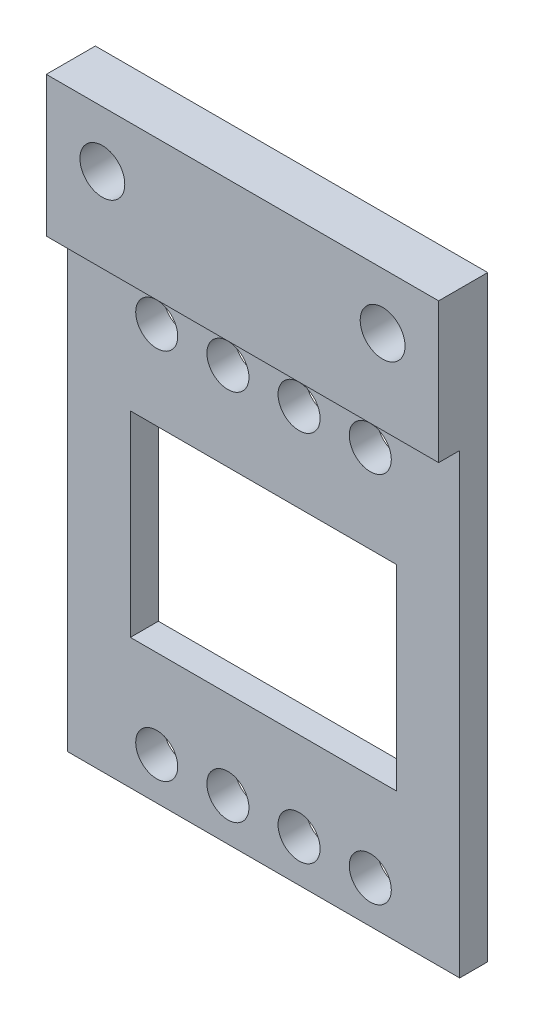
ISO-10303-21;
HEADER;
FILE_DESCRIPTION(('STEP AP214'),'2;1');
FILE_NAME('part.step','',(''),(''),'','','');
FILE_SCHEMA(('AUTOMOTIVE_DESIGN { 1 0 10303 214 1 1 1 1 }'));
ENDSEC;
DATA;
#1=APPLICATION_CONTEXT('core data for automotive mechanical design processes');
#2=APPLICATION_PROTOCOL_DEFINITION('international standard','automotive_design',2000,#1);
#3=PRODUCT_CONTEXT('',#1,'mechanical');
#4=PRODUCT('Part','Part','',(#3));
#5=PRODUCT_RELATED_PRODUCT_CATEGORY('part','',(#4));
#6=PRODUCT_DEFINITION_FORMATION('','',#4);
#7=PRODUCT_DEFINITION_CONTEXT('part definition',#1,'design');
#8=PRODUCT_DEFINITION('design','',#6,#7);
#9=PRODUCT_DEFINITION_SHAPE('','',#8);
#10=(LENGTH_UNIT() NAMED_UNIT(*) SI_UNIT(.MILLI.,.METRE.));
#11=(NAMED_UNIT(*) PLANE_ANGLE_UNIT() SI_UNIT($,.RADIAN.));
#12=(NAMED_UNIT(*) SI_UNIT($,.STERADIAN.) SOLID_ANGLE_UNIT());
#13=UNCERTAINTY_MEASURE_WITH_UNIT(LENGTH_MEASURE(1.E-05),#10,'distance_accuracy_value','');
#14=(GEOMETRIC_REPRESENTATION_CONTEXT(3) GLOBAL_UNCERTAINTY_ASSIGNED_CONTEXT((#13)) GLOBAL_UNIT_ASSIGNED_CONTEXT((#10,
#11,#12)) REPRESENTATION_CONTEXT('',''));
#15=CARTESIAN_POINT('',(0.,0.,0.));
#16=DIRECTION('',(0.,0.,1.));
#17=DIRECTION('',(1.,0.,0.));
#18=AXIS2_PLACEMENT_3D('',#15,#16,#17);
#19=CARTESIAN_POINT('',(0.,0.,0.));
#20=DIRECTION('',(0.,0.,1.));
#21=DIRECTION('',(1.,0.,0.));
#22=AXIS2_PLACEMENT_3D('',#19,#20,#21);
#23=PLANE('',#22);
#24=CARTESIAN_POINT('',(-1.27000000000001,6.65,0.));
#25=DIRECTION('',(0.,0.,-1.));
#26=DIRECTION('',(-1.,0.,0.));
#27=AXIS2_PLACEMENT_3D('',#24,#25,#26);
#28=CIRCLE('',#27,0.75);
#29=CARTESIAN_POINT('',(-2.02000000000001,6.65,0.));
#30=VERTEX_POINT('',#29);
#31=EDGE_CURVE('E315',#30,#30,#28,.T.);
#32=ORIENTED_EDGE('',*,*,#31,.F.);
#33=EDGE_LOOP('',(#32));
#34=FACE_BOUND('',#33,.T.);
#35=CARTESIAN_POINT('',(1.26999999999999,6.65,0.));
#36=DIRECTION('',(0.,0.,-1.));
#37=DIRECTION('',(-1.,0.,0.));
#38=AXIS2_PLACEMENT_3D('',#35,#36,#37);
#39=CIRCLE('',#38,0.75);
#40=CARTESIAN_POINT('',(0.519999999999994,6.65,0.));
#41=VERTEX_POINT('',#40);
#42=EDGE_CURVE('E321',#41,#41,#39,.T.);
#43=ORIENTED_EDGE('',*,*,#42,.F.);
#44=EDGE_LOOP('',(#43));
#45=FACE_BOUND('',#44,.T.);
#46=CARTESIAN_POINT('',(3.80999999999999,6.65,0.));
#47=DIRECTION('',(0.,0.,-1.));
#48=DIRECTION('',(-1.,0.,0.));
#49=AXIS2_PLACEMENT_3D('',#46,#47,#48);
#50=CIRCLE('',#49,0.75);
#51=CARTESIAN_POINT('',(3.05999999999999,6.65,0.));
#52=VERTEX_POINT('',#51);
#53=EDGE_CURVE('E327',#52,#52,#50,.T.);
#54=ORIENTED_EDGE('',*,*,#53,.F.);
#55=EDGE_LOOP('',(#54));
#56=FACE_BOUND('',#55,.T.);
#57=CARTESIAN_POINT('',(3.81,-6.65,0.));
#58=DIRECTION('',(0.,0.,-1.));
#59=DIRECTION('',(-1.,0.,0.));
#60=AXIS2_PLACEMENT_3D('',#57,#58,#59);
#61=CIRCLE('',#60,0.75);
#62=CARTESIAN_POINT('',(3.06,-6.65,0.));
#63=VERTEX_POINT('',#62);
#64=EDGE_CURVE('E333',#63,#63,#61,.T.);
#65=ORIENTED_EDGE('',*,*,#64,.F.);
#66=EDGE_LOOP('',(#65));
#67=FACE_BOUND('',#66,.T.);
#68=CARTESIAN_POINT('',(1.27,-6.65,0.));
#69=DIRECTION('',(0.,0.,-1.));
#70=DIRECTION('',(-1.,0.,0.));
#71=AXIS2_PLACEMENT_3D('',#68,#69,#70);
#72=CIRCLE('',#71,0.75);
#73=CARTESIAN_POINT('',(0.52,-6.65,0.));
#74=VERTEX_POINT('',#73);
#75=EDGE_CURVE('E339',#74,#74,#72,.T.);
#76=ORIENTED_EDGE('',*,*,#75,.F.);
#77=EDGE_LOOP('',(#76));
#78=FACE_BOUND('',#77,.T.);
#79=CARTESIAN_POINT('',(-1.27,-6.65,0.));
#80=DIRECTION('',(0.,0.,-1.));
#81=DIRECTION('',(-1.,0.,0.));
#82=AXIS2_PLACEMENT_3D('',#79,#80,#81);
#83=CIRCLE('',#82,0.75);
#84=CARTESIAN_POINT('',(-2.02,-6.65,0.));
#85=VERTEX_POINT('',#84);
#86=EDGE_CURVE('E345',#85,#85,#83,.T.);
#87=ORIENTED_EDGE('',*,*,#86,.F.);
#88=EDGE_LOOP('',(#87));
#89=FACE_BOUND('',#88,.T.);
#90=CARTESIAN_POINT('',(-3.81,-6.65,0.));
#91=DIRECTION('',(0.,0.,-1.));
#92=DIRECTION('',(-1.,0.,0.));
#93=AXIS2_PLACEMENT_3D('',#90,#91,#92);
#94=CIRCLE('',#93,0.75);
#95=CARTESIAN_POINT('',(-4.56,-6.65,0.));
#96=VERTEX_POINT('',#95);
#97=EDGE_CURVE('E351',#96,#96,#94,.T.);
#98=ORIENTED_EDGE('',*,*,#97,.F.);
#99=EDGE_LOOP('',(#98));
#100=FACE_BOUND('',#99,.T.);
#101=DIRECTION('',(1.,0.,0.));
#102=VECTOR('',#101,1.);
#103=CARTESIAN_POINT('',(0.,-3.5,0.));
#104=LINE('',#103,#102);
#105=CARTESIAN_POINT('',(-4.75,-3.5,0.));
#106=VERTEX_POINT('',#105);
#107=CARTESIAN_POINT('',(4.75,-3.5,0.));
#108=VERTEX_POINT('',#107);
#109=EDGE_CURVE('E122',#106,#108,#104,.T.);
#110=ORIENTED_EDGE('',*,*,#109,.T.);
#111=DIRECTION('',(0.,-1.,0.));
#112=VECTOR('',#111,1.);
#113=CARTESIAN_POINT('',(4.75,0.,0.));
#114=LINE('',#113,#112);
#115=CARTESIAN_POINT('',(4.75,3.5,0.));
#116=VERTEX_POINT('',#115);
#117=EDGE_CURVE('E60',#116,#108,#114,.T.);
#118=ORIENTED_EDGE('',*,*,#117,.F.);
#119=DIRECTION('',(1.,0.,0.));
#120=VECTOR('',#119,1.);
#121=CARTESIAN_POINT('',(0.,3.5,0.));
#122=LINE('',#121,#120);
#123=CARTESIAN_POINT('',(-4.75,3.5,0.));
#124=VERTEX_POINT('',#123);
#125=EDGE_CURVE('E136',#124,#116,#122,.T.);
#126=ORIENTED_EDGE('',*,*,#125,.F.);
#127=DIRECTION('',(0.,-1.,0.));
#128=VECTOR('',#127,1.);
#129=CARTESIAN_POINT('',(-4.75,0.,0.));
#130=LINE('',#129,#128);
#131=EDGE_CURVE('E143',#124,#106,#130,.T.);
#132=ORIENTED_EDGE('',*,*,#131,.T.);
#133=EDGE_LOOP('',(#110,#118,#126,#132));
#134=FACE_BOUND('',#133,.T.);
#135=DIRECTION('',(0.,-1.,0.));
#136=VECTOR('',#135,1.);
#137=CARTESIAN_POINT('',(7.,0.,0.));
#138=LINE('',#137,#136);
#139=CARTESIAN_POINT('',(7.,13.15,0.));
#140=VERTEX_POINT('',#139);
#141=CARTESIAN_POINT('',(7.,-8.15,0.));
#142=VERTEX_POINT('',#141);
#143=EDGE_CURVE('E167',#140,#142,#138,.T.);
#144=ORIENTED_EDGE('',*,*,#143,.T.);
#145=DIRECTION('',(1.,0.,0.));
#146=VECTOR('',#145,1.);
#147=CARTESIAN_POINT('',(0.,-8.15,0.));
#148=LINE('',#147,#146);
#149=CARTESIAN_POINT('',(-7.,-8.15,0.));
#150=VERTEX_POINT('',#149);
#151=EDGE_CURVE('E180',#150,#142,#148,.T.);
#152=ORIENTED_EDGE('',*,*,#151,.F.);
#153=DIRECTION('',(0.,-1.,0.));
#154=VECTOR('',#153,1.);
#155=CARTESIAN_POINT('',(-7.,0.,0.));
#156=LINE('',#155,#154);
#157=CARTESIAN_POINT('',(-7.,13.15,0.));
#158=VERTEX_POINT('',#157);
#159=EDGE_CURVE('E189',#158,#150,#156,.T.);
#160=ORIENTED_EDGE('',*,*,#159,.F.);
#161=DIRECTION('',(-1.,0.,0.));
#162=VECTOR('',#161,1.);
#163=CARTESIAN_POINT('',(7.,13.15,0.));
#164=LINE('',#163,#162);
#165=EDGE_CURVE('E128',#140,#158,#164,.T.);
#166=ORIENTED_EDGE('',*,*,#165,.F.);
#167=EDGE_LOOP('',(#144,#152,#160,#166));
#168=FACE_BOUND('',#167,.T.);
#169=CARTESIAN_POINT('',(-3.81000000000001,6.65,0.));
#170=DIRECTION('',(0.,0.,-1.));
#171=DIRECTION('',(-1.,0.,0.));
#172=AXIS2_PLACEMENT_3D('',#169,#170,#171);
#173=CIRCLE('',#172,0.75);
#174=CARTESIAN_POINT('',(-4.56000000000001,6.65,0.));
#175=VERTEX_POINT('',#174);
#176=EDGE_CURVE('E309',#175,#175,#173,.T.);
#177=ORIENTED_EDGE('',*,*,#176,.F.);
#178=EDGE_LOOP('',(#177));
#179=FACE_BOUND('',#178,.T.);
#180=CARTESIAN_POINT('',(-5.,11.15,0.));
#181=DIRECTION('',(0.,0.,-1.));
#182=DIRECTION('',(-1.,0.,0.));
#183=AXIS2_PLACEMENT_3D('',#180,#181,#182);
#184=CIRCLE('',#183,0.799999999999999);
#185=CARTESIAN_POINT('',(-5.8,11.15,0.));
#186=VERTEX_POINT('',#185);
#187=EDGE_CURVE('E300',#186,#186,#184,.T.);
#188=ORIENTED_EDGE('',*,*,#187,.F.);
#189=EDGE_LOOP('',(#188));
#190=FACE_BOUND('',#189,.T.);
#191=CARTESIAN_POINT('',(5.,11.15,0.));
#192=DIRECTION('',(0.,0.,-1.));
#193=DIRECTION('',(-1.,0.,0.));
#194=AXIS2_PLACEMENT_3D('',#191,#192,#193);
#195=CIRCLE('',#194,0.799999999999999);
#196=CARTESIAN_POINT('',(4.2,11.15,0.));
#197=VERTEX_POINT('',#196);
#198=EDGE_CURVE('E296',#197,#197,#195,.T.);
#199=ORIENTED_EDGE('',*,*,#198,.F.);
#200=EDGE_LOOP('',(#199));
#201=FACE_BOUND('',#200,.T.);
#202=ADVANCED_FACE('F37',(#34,#45,#56,#67,#78,#89,#100,#134,#168,#179,#190,#201),#23,.F.);
#203=CARTESIAN_POINT('',(7.,0.,1.));
#204=DIRECTION('',(1.,0.,0.));
#205=DIRECTION('',(0.,1.,0.));
#206=AXIS2_PLACEMENT_3D('',#203,#204,#205);
#207=PLANE('',#206);
#208=ORIENTED_EDGE('',*,*,#143,.F.);
#209=DIRECTION('',(0.,0.,-1.));
#210=VECTOR('',#209,1.);
#211=CARTESIAN_POINT('',(7.,13.15,1.75));
#212=LINE('',#211,#210);
#213=CARTESIAN_POINT('',(7.,13.15,1.75));
#214=VERTEX_POINT('',#213);
#215=EDGE_CURVE('E171',#214,#140,#212,.T.);
#216=ORIENTED_EDGE('',*,*,#215,.F.);
#217=DIRECTION('',(0.,1.,0.));
#218=VECTOR('',#217,1.);
#219=CARTESIAN_POINT('',(7.,8.15,1.75));
#220=LINE('',#219,#218);
#221=CARTESIAN_POINT('',(7.,8.15,1.75));
#222=VERTEX_POINT('',#221);
#223=EDGE_CURVE('E156',#222,#214,#220,.T.);
#224=ORIENTED_EDGE('',*,*,#223,.F.);
#225=DIRECTION('',(0.,0.,-1.));
#226=VECTOR('',#225,1.);
#227=CARTESIAN_POINT('',(7.,8.15,1.75));
#228=LINE('',#227,#226);
#229=CARTESIAN_POINT('',(7.,8.15,1.));
#230=VERTEX_POINT('',#229);
#231=EDGE_CURVE('E168',#222,#230,#228,.T.);
#232=ORIENTED_EDGE('',*,*,#231,.T.);
#233=DIRECTION('',(0.,-1.,0.));
#234=VECTOR('',#233,1.);
#235=CARTESIAN_POINT('',(7.,0.,1.));
#236=LINE('',#235,#234);
#237=CARTESIAN_POINT('',(7.,-8.15,1.));
#238=VERTEX_POINT('',#237);
#239=EDGE_CURVE('E176',#230,#238,#236,.T.);
#240=ORIENTED_EDGE('',*,*,#239,.T.);
#241=DIRECTION('',(0.,0.,-1.));
#242=VECTOR('',#241,1.);
#243=CARTESIAN_POINT('',(7.,-8.15,1.));
#244=LINE('',#243,#242);
#245=EDGE_CURVE('E45',#238,#142,#244,.T.);
#246=ORIENTED_EDGE('',*,*,#245,.T.);
#247=EDGE_LOOP('',(#208,#216,#224,#232,#240,#246));
#248=FACE_BOUND('',#247,.T.);
#249=ADVANCED_FACE('F39',(#248),#207,.T.);
#250=CARTESIAN_POINT('',(-7.,0.,1.));
#251=DIRECTION('',(1.,0.,0.));
#252=DIRECTION('',(0.,1.,0.));
#253=AXIS2_PLACEMENT_3D('',#250,#251,#252);
#254=PLANE('',#253);
#255=ORIENTED_EDGE('',*,*,#159,.T.);
#256=DIRECTION('',(0.,0.,-1.));
#257=VECTOR('',#256,1.);
#258=CARTESIAN_POINT('',(-7.,-8.15,1.));
#259=LINE('',#258,#257);
#260=CARTESIAN_POINT('',(-7.,-8.15,1.));
#261=VERTEX_POINT('',#260);
#262=EDGE_CURVE('E11',#261,#150,#259,.T.);
#263=ORIENTED_EDGE('',*,*,#262,.F.);
#264=DIRECTION('',(0.,-1.,0.));
#265=VECTOR('',#264,1.);
#266=CARTESIAN_POINT('',(-7.,0.,1.));
#267=LINE('',#266,#265);
#268=CARTESIAN_POINT('',(-7.,8.15,1.));
#269=VERTEX_POINT('',#268);
#270=EDGE_CURVE('E183',#269,#261,#267,.T.);
#271=ORIENTED_EDGE('',*,*,#270,.F.);
#272=DIRECTION('',(0.,0.,-1.));
#273=VECTOR('',#272,1.);
#274=CARTESIAN_POINT('',(-7.,8.15,1.75));
#275=LINE('',#274,#273);
#276=CARTESIAN_POINT('',(-7.,8.15,1.75));
#277=VERTEX_POINT('',#276);
#278=EDGE_CURVE('E164',#277,#269,#275,.T.);
#279=ORIENTED_EDGE('',*,*,#278,.F.);
#280=DIRECTION('',(0.,1.,0.));
#281=VECTOR('',#280,1.);
#282=CARTESIAN_POINT('',(-7.,8.15,1.75));
#283=LINE('',#282,#281);
#284=CARTESIAN_POINT('',(-7.,13.15,1.75));
#285=VERTEX_POINT('',#284);
#286=EDGE_CURVE('E151',#277,#285,#283,.T.);
#287=ORIENTED_EDGE('',*,*,#286,.T.);
#288=DIRECTION('',(0.,0.,-1.));
#289=VECTOR('',#288,1.);
#290=CARTESIAN_POINT('',(-7.,13.15,1.75));
#291=LINE('',#290,#289);
#292=EDGE_CURVE('E161',#285,#158,#291,.T.);
#293=ORIENTED_EDGE('',*,*,#292,.T.);
#294=EDGE_LOOP('',(#255,#263,#271,#279,#287,#293));
#295=FACE_BOUND('',#294,.T.);
#296=ADVANCED_FACE('F216',(#295),#254,.F.);
#297=CARTESIAN_POINT('',(0.,-8.15,1.));
#298=DIRECTION('',(0.,1.,0.));
#299=DIRECTION('',(0.,0.,1.));
#300=AXIS2_PLACEMENT_3D('',#297,#298,#299);
#301=PLANE('',#300);
#302=ORIENTED_EDGE('',*,*,#151,.T.);
#303=ORIENTED_EDGE('',*,*,#245,.F.);
#304=DIRECTION('',(1.,0.,0.));
#305=VECTOR('',#304,1.);
#306=CARTESIAN_POINT('',(0.,-8.15,1.));
#307=LINE('',#306,#305);
#308=EDGE_CURVE('E185',#261,#238,#307,.T.);
#309=ORIENTED_EDGE('',*,*,#308,.F.);
#310=ORIENTED_EDGE('',*,*,#262,.T.);
#311=EDGE_LOOP('',(#302,#303,#309,#310));
#312=FACE_BOUND('',#311,.T.);
#313=ADVANCED_FACE('F198',(#312),#301,.F.);
#314=CARTESIAN_POINT('',(0.,0.,1.));
#315=DIRECTION('',(0.,0.,1.));
#316=DIRECTION('',(1.,0.,0.));
#317=AXIS2_PLACEMENT_3D('',#314,#315,#316);
#318=PLANE('',#317);
#319=CARTESIAN_POINT('',(-3.81000000000001,6.65,1.));
#320=DIRECTION('',(0.,0.,1.));
#321=DIRECTION('',(1.,0.,0.));
#322=AXIS2_PLACEMENT_3D('',#319,#320,#321);
#323=CIRCLE('',#322,0.75);
#324=CARTESIAN_POINT('',(-3.06000000000001,6.65,1.));
#325=VERTEX_POINT('',#324);
#326=EDGE_CURVE('E312',#325,#325,#323,.T.);
#327=ORIENTED_EDGE('',*,*,#326,.F.);
#328=EDGE_LOOP('',(#327));
#329=FACE_BOUND('',#328,.T.);
#330=CARTESIAN_POINT('',(-1.27000000000001,6.65,1.));
#331=DIRECTION('',(0.,0.,1.));
#332=DIRECTION('',(1.,0.,0.));
#333=AXIS2_PLACEMENT_3D('',#330,#331,#332);
#334=CIRCLE('',#333,0.75);
#335=CARTESIAN_POINT('',(-0.520000000000007,6.65,1.));
#336=VERTEX_POINT('',#335);
#337=EDGE_CURVE('E318',#336,#336,#334,.T.);
#338=ORIENTED_EDGE('',*,*,#337,.F.);
#339=EDGE_LOOP('',(#338));
#340=FACE_BOUND('',#339,.T.);
#341=CARTESIAN_POINT('',(1.26999999999999,6.65,1.));
#342=DIRECTION('',(0.,0.,1.));
#343=DIRECTION('',(1.,0.,0.));
#344=AXIS2_PLACEMENT_3D('',#341,#342,#343);
#345=CIRCLE('',#344,0.75);
#346=CARTESIAN_POINT('',(2.01999999999999,6.65,1.));
#347=VERTEX_POINT('',#346);
#348=EDGE_CURVE('E324',#347,#347,#345,.T.);
#349=ORIENTED_EDGE('',*,*,#348,.F.);
#350=EDGE_LOOP('',(#349));
#351=FACE_BOUND('',#350,.T.);
#352=CARTESIAN_POINT('',(3.80999999999999,6.65,1.));
#353=DIRECTION('',(0.,0.,1.));
#354=DIRECTION('',(1.,0.,0.));
#355=AXIS2_PLACEMENT_3D('',#352,#353,#354);
#356=CIRCLE('',#355,0.75);
#357=CARTESIAN_POINT('',(4.55999999999999,6.65,1.));
#358=VERTEX_POINT('',#357);
#359=EDGE_CURVE('E330',#358,#358,#356,.T.);
#360=ORIENTED_EDGE('',*,*,#359,.F.);
#361=EDGE_LOOP('',(#360));
#362=FACE_BOUND('',#361,.T.);
#363=CARTESIAN_POINT('',(3.81,-6.65,1.));
#364=DIRECTION('',(0.,0.,1.));
#365=DIRECTION('',(1.,0.,0.));
#366=AXIS2_PLACEMENT_3D('',#363,#364,#365);
#367=CIRCLE('',#366,0.75);
#368=CARTESIAN_POINT('',(4.56,-6.65,1.));
#369=VERTEX_POINT('',#368);
#370=EDGE_CURVE('E336',#369,#369,#367,.T.);
#371=ORIENTED_EDGE('',*,*,#370,.F.);
#372=EDGE_LOOP('',(#371));
#373=FACE_BOUND('',#372,.T.);
#374=CARTESIAN_POINT('',(1.27,-6.65,1.));
#375=DIRECTION('',(0.,0.,1.));
#376=DIRECTION('',(1.,0.,0.));
#377=AXIS2_PLACEMENT_3D('',#374,#375,#376);
#378=CIRCLE('',#377,0.75);
#379=CARTESIAN_POINT('',(2.02,-6.65,1.));
#380=VERTEX_POINT('',#379);
#381=EDGE_CURVE('E342',#380,#380,#378,.T.);
#382=ORIENTED_EDGE('',*,*,#381,.F.);
#383=EDGE_LOOP('',(#382));
#384=FACE_BOUND('',#383,.T.);
#385=CARTESIAN_POINT('',(-1.27,-6.65,1.));
#386=DIRECTION('',(0.,0.,1.));
#387=DIRECTION('',(1.,0.,0.));
#388=AXIS2_PLACEMENT_3D('',#385,#386,#387);
#389=CIRCLE('',#388,0.75);
#390=CARTESIAN_POINT('',(-0.52,-6.65,1.));
#391=VERTEX_POINT('',#390);
#392=EDGE_CURVE('E348',#391,#391,#389,.T.);
#393=ORIENTED_EDGE('',*,*,#392,.F.);
#394=EDGE_LOOP('',(#393));
#395=FACE_BOUND('',#394,.T.);
#396=CARTESIAN_POINT('',(-3.81,-6.65,1.));
#397=DIRECTION('',(0.,0.,1.));
#398=DIRECTION('',(1.,0.,0.));
#399=AXIS2_PLACEMENT_3D('',#396,#397,#398);
#400=CIRCLE('',#399,0.75);
#401=CARTESIAN_POINT('',(-3.06,-6.65,1.));
#402=VERTEX_POINT('',#401);
#403=EDGE_CURVE('E354',#402,#402,#400,.T.);
#404=ORIENTED_EDGE('',*,*,#403,.F.);
#405=EDGE_LOOP('',(#404));
#406=FACE_BOUND('',#405,.T.);
#407=DIRECTION('',(0.,-1.,0.));
#408=VECTOR('',#407,1.);
#409=CARTESIAN_POINT('',(4.75,0.,1.));
#410=LINE('',#409,#408);
#411=CARTESIAN_POINT('',(4.75,3.5,1.));
#412=VERTEX_POINT('',#411);
#413=CARTESIAN_POINT('',(4.75,-3.5,1.));
#414=VERTEX_POINT('',#413);
#415=EDGE_CURVE('E116',#412,#414,#410,.T.);
#416=ORIENTED_EDGE('',*,*,#415,.T.);
#417=DIRECTION('',(1.,0.,0.));
#418=VECTOR('',#417,1.);
#419=CARTESIAN_POINT('',(0.,-3.5,1.));
#420=LINE('',#419,#418);
#421=CARTESIAN_POINT('',(-4.75,-3.5,1.));
#422=VERTEX_POINT('',#421);
#423=EDGE_CURVE('E125',#422,#414,#420,.T.);
#424=ORIENTED_EDGE('',*,*,#423,.F.);
#425=DIRECTION('',(0.,-1.,0.));
#426=VECTOR('',#425,1.);
#427=CARTESIAN_POINT('',(-4.75,0.,1.));
#428=LINE('',#427,#426);
#429=CARTESIAN_POINT('',(-4.75,3.5,1.));
#430=VERTEX_POINT('',#429);
#431=EDGE_CURVE('E52',#430,#422,#428,.T.);
#432=ORIENTED_EDGE('',*,*,#431,.F.);
#433=DIRECTION('',(1.,0.,0.));
#434=VECTOR('',#433,1.);
#435=CARTESIAN_POINT('',(0.,3.5,1.));
#436=LINE('',#435,#434);
#437=EDGE_CURVE('E134',#430,#412,#436,.T.);
#438=ORIENTED_EDGE('',*,*,#437,.T.);
#439=EDGE_LOOP('',(#416,#424,#432,#438));
#440=FACE_BOUND('',#439,.T.);
#441=ORIENTED_EDGE('',*,*,#239,.F.);
#442=DIRECTION('',(1.,0.,0.));
#443=VECTOR('',#442,1.);
#444=CARTESIAN_POINT('',(0.,8.15,1.));
#445=LINE('',#444,#443);
#446=EDGE_CURVE('E179',#269,#230,#445,.T.);
#447=ORIENTED_EDGE('',*,*,#446,.F.);
#448=ORIENTED_EDGE('',*,*,#270,.T.);
#449=ORIENTED_EDGE('',*,*,#308,.T.);
#450=EDGE_LOOP('',(#441,#447,#448,#449));
#451=FACE_BOUND('',#450,.T.);
#452=ADVANCED_FACE('F131',(#329,#340,#351,#362,#373,#384,#395,#406,#440,#451),#318,.T.);
#453=CARTESIAN_POINT('',(7.,8.15,1.75));
#454=DIRECTION('',(0.,-1.,0.));
#455=DIRECTION('',(0.,0.,-1.));
#456=AXIS2_PLACEMENT_3D('',#453,#454,#455);
#457=PLANE('',#456);
#458=ORIENTED_EDGE('',*,*,#278,.T.);
#459=ORIENTED_EDGE('',*,*,#446,.T.);
#460=ORIENTED_EDGE('',*,*,#231,.F.);
#461=DIRECTION('',(-1.,0.,0.));
#462=VECTOR('',#461,1.);
#463=CARTESIAN_POINT('',(7.,8.15,1.75));
#464=LINE('',#463,#462);
#465=EDGE_CURVE('E158',#222,#277,#464,.T.);
#466=ORIENTED_EDGE('',*,*,#465,.T.);
#467=EDGE_LOOP('',(#458,#459,#460,#466));
#468=FACE_BOUND('',#467,.T.);
#469=ADVANCED_FACE('F213',(#468),#457,.T.);
#470=CARTESIAN_POINT('',(7.,13.15,1.75));
#471=DIRECTION('',(0.,-1.,0.));
#472=DIRECTION('',(0.,0.,-1.));
#473=AXIS2_PLACEMENT_3D('',#470,#471,#472);
#474=PLANE('',#473);
#475=ORIENTED_EDGE('',*,*,#165,.T.);
#476=ORIENTED_EDGE('',*,*,#292,.F.);
#477=DIRECTION('',(-1.,0.,0.));
#478=VECTOR('',#477,1.);
#479=CARTESIAN_POINT('',(7.,13.15,1.75));
#480=LINE('',#479,#478);
#481=EDGE_CURVE('E154',#214,#285,#480,.T.);
#482=ORIENTED_EDGE('',*,*,#481,.F.);
#483=ORIENTED_EDGE('',*,*,#215,.T.);
#484=EDGE_LOOP('',(#475,#476,#482,#483));
#485=FACE_BOUND('',#484,.T.);
#486=ADVANCED_FACE('F205',(#485),#474,.F.);
#487=CARTESIAN_POINT('',(0.,0.,1.75));
#488=DIRECTION('',(0.,0.,1.));
#489=DIRECTION('',(1.,0.,0.));
#490=AXIS2_PLACEMENT_3D('',#487,#488,#489);
#491=PLANE('',#490);
#492=CARTESIAN_POINT('',(5.,11.15,1.75));
#493=DIRECTION('',(0.,0.,1.));
#494=DIRECTION('',(1.,0.,0.));
#495=AXIS2_PLACEMENT_3D('',#492,#493,#494);
#496=CIRCLE('',#495,0.799999999999999);
#497=CARTESIAN_POINT('',(5.8,11.15,1.75));
#498=VERTEX_POINT('',#497);
#499=EDGE_CURVE('E299',#498,#498,#496,.T.);
#500=ORIENTED_EDGE('',*,*,#499,.F.);
#501=EDGE_LOOP('',(#500));
#502=FACE_BOUND('',#501,.T.);
#503=CARTESIAN_POINT('',(-5.,11.15,1.75));
#504=DIRECTION('',(0.,0.,1.));
#505=DIRECTION('',(1.,0.,0.));
#506=AXIS2_PLACEMENT_3D('',#503,#504,#505);
#507=CIRCLE('',#506,0.799999999999999);
#508=CARTESIAN_POINT('',(-4.2,11.15,1.75));
#509=VERTEX_POINT('',#508);
#510=EDGE_CURVE('E303',#509,#509,#507,.T.);
#511=ORIENTED_EDGE('',*,*,#510,.F.);
#512=EDGE_LOOP('',(#511));
#513=FACE_BOUND('',#512,.T.);
#514=ORIENTED_EDGE('',*,*,#286,.F.);
#515=ORIENTED_EDGE('',*,*,#465,.F.);
#516=ORIENTED_EDGE('',*,*,#223,.T.);
#517=ORIENTED_EDGE('',*,*,#481,.T.);
#518=EDGE_LOOP('',(#514,#515,#516,#517));
#519=FACE_BOUND('',#518,.T.);
#520=ADVANCED_FACE('F211',(#502,#513,#519),#491,.T.);
#521=CARTESIAN_POINT('',(4.75,0.,1.751));
#522=DIRECTION('',(1.,0.,0.));
#523=DIRECTION('',(0.,0.,-1.));
#524=AXIS2_PLACEMENT_3D('',#521,#522,#523);
#525=PLANE('',#524);
#526=DIRECTION('',(0.,0.,-1.));
#527=VECTOR('',#526,1.);
#528=CARTESIAN_POINT('',(4.75,3.5,1.751));
#529=LINE('',#528,#527);
#530=EDGE_CURVE('E129',#412,#116,#529,.T.);
#531=ORIENTED_EDGE('',*,*,#530,.T.);
#532=ORIENTED_EDGE('',*,*,#117,.T.);
#533=DIRECTION('',(0.,0.,-1.));
#534=VECTOR('',#533,1.);
#535=CARTESIAN_POINT('',(4.75,-3.5,1.751));
#536=LINE('',#535,#534);
#537=EDGE_CURVE('E112',#414,#108,#536,.T.);
#538=ORIENTED_EDGE('',*,*,#537,.F.);
#539=ORIENTED_EDGE('',*,*,#415,.F.);
#540=EDGE_LOOP('',(#531,#532,#538,#539));
#541=FACE_BOUND('',#540,.T.);
#542=ADVANCED_FACE('F114',(#541),#525,.F.);
#543=CARTESIAN_POINT('',(0.,3.5,1.751));
#544=DIRECTION('',(0.,1.,0.));
#545=DIRECTION('',(0.,0.,1.));
#546=AXIS2_PLACEMENT_3D('',#543,#544,#545);
#547=PLANE('',#546);
#548=DIRECTION('',(0.,0.,-1.));
#549=VECTOR('',#548,1.);
#550=CARTESIAN_POINT('',(-4.75,3.5,1.751));
#551=LINE('',#550,#549);
#552=EDGE_CURVE('E148',#430,#124,#551,.T.);
#553=ORIENTED_EDGE('',*,*,#552,.T.);
#554=ORIENTED_EDGE('',*,*,#125,.T.);
#555=ORIENTED_EDGE('',*,*,#530,.F.);
#556=ORIENTED_EDGE('',*,*,#437,.F.);
#557=EDGE_LOOP('',(#553,#554,#555,#556));
#558=FACE_BOUND('',#557,.T.);
#559=ADVANCED_FACE('F243',(#558),#547,.F.);
#560=CARTESIAN_POINT('',(-4.75,0.,1.751));
#561=DIRECTION('',(1.,0.,0.));
#562=DIRECTION('',(0.,1.,0.));
#563=AXIS2_PLACEMENT_3D('',#560,#561,#562);
#564=PLANE('',#563);
#565=ORIENTED_EDGE('',*,*,#431,.T.);
#566=DIRECTION('',(0.,0.,-1.));
#567=VECTOR('',#566,1.);
#568=CARTESIAN_POINT('',(-4.75,-3.5,1.751));
#569=LINE('',#568,#567);
#570=EDGE_CURVE('E121',#422,#106,#569,.T.);
#571=ORIENTED_EDGE('',*,*,#570,.T.);
#572=ORIENTED_EDGE('',*,*,#131,.F.);
#573=ORIENTED_EDGE('',*,*,#552,.F.);
#574=EDGE_LOOP('',(#565,#571,#572,#573));
#575=FACE_BOUND('',#574,.T.);
#576=ADVANCED_FACE('F246',(#575),#564,.T.);
#577=CARTESIAN_POINT('',(0.,-3.5,1.751));
#578=DIRECTION('',(0.,1.,0.));
#579=DIRECTION('',(0.,0.,1.));
#580=AXIS2_PLACEMENT_3D('',#577,#578,#579);
#581=PLANE('',#580);
#582=ORIENTED_EDGE('',*,*,#423,.T.);
#583=ORIENTED_EDGE('',*,*,#537,.T.);
#584=ORIENTED_EDGE('',*,*,#109,.F.);
#585=ORIENTED_EDGE('',*,*,#570,.F.);
#586=EDGE_LOOP('',(#582,#583,#584,#585));
#587=FACE_BOUND('',#586,.T.);
#588=ADVANCED_FACE('F126',(#587),#581,.T.);
#589=CARTESIAN_POINT('',(-3.81,-6.65,0.));
#590=DIRECTION('',(0.,0.,-1.));
#591=DIRECTION('',(-1.,0.,0.));
#592=AXIS2_PLACEMENT_3D('',#589,#590,#591);
#593=CYLINDRICAL_SURFACE('',#592,0.75);
#594=ORIENTED_EDGE('',*,*,#97,.T.);
#595=EDGE_LOOP('',(#594));
#596=FACE_BOUND('',#595,.T.);
#597=ORIENTED_EDGE('',*,*,#403,.T.);
#598=EDGE_LOOP('',(#597));
#599=FACE_BOUND('',#598,.T.);
#600=ADVANCED_FACE('F252',(#596,#599),#593,.F.);
#601=CARTESIAN_POINT('',(-1.27,-6.65,0.));
#602=DIRECTION('',(0.,0.,-1.));
#603=DIRECTION('',(-1.,0.,0.));
#604=AXIS2_PLACEMENT_3D('',#601,#602,#603);
#605=CYLINDRICAL_SURFACE('',#604,0.75);
#606=ORIENTED_EDGE('',*,*,#86,.T.);
#607=EDGE_LOOP('',(#606));
#608=FACE_BOUND('',#607,.T.);
#609=ORIENTED_EDGE('',*,*,#392,.T.);
#610=EDGE_LOOP('',(#609));
#611=FACE_BOUND('',#610,.T.);
#612=ADVANCED_FACE('F255',(#608,#611),#605,.F.);
#613=CARTESIAN_POINT('',(1.27,-6.65,0.));
#614=DIRECTION('',(0.,0.,-1.));
#615=DIRECTION('',(-1.,0.,0.));
#616=AXIS2_PLACEMENT_3D('',#613,#614,#615);
#617=CYLINDRICAL_SURFACE('',#616,0.75);
#618=ORIENTED_EDGE('',*,*,#75,.T.);
#619=EDGE_LOOP('',(#618));
#620=FACE_BOUND('',#619,.T.);
#621=ORIENTED_EDGE('',*,*,#381,.T.);
#622=EDGE_LOOP('',(#621));
#623=FACE_BOUND('',#622,.T.);
#624=ADVANCED_FACE('F259',(#620,#623),#617,.F.);
#625=CARTESIAN_POINT('',(3.81,-6.65,0.));
#626=DIRECTION('',(0.,0.,-1.));
#627=DIRECTION('',(-1.,0.,0.));
#628=AXIS2_PLACEMENT_3D('',#625,#626,#627);
#629=CYLINDRICAL_SURFACE('',#628,0.75);
#630=ORIENTED_EDGE('',*,*,#64,.T.);
#631=EDGE_LOOP('',(#630));
#632=FACE_BOUND('',#631,.T.);
#633=ORIENTED_EDGE('',*,*,#370,.T.);
#634=EDGE_LOOP('',(#633));
#635=FACE_BOUND('',#634,.T.);
#636=ADVANCED_FACE('F263',(#632,#635),#629,.F.);
#637=CARTESIAN_POINT('',(3.80999999999999,6.65,0.));
#638=DIRECTION('',(0.,0.,-1.));
#639=DIRECTION('',(-1.,0.,0.));
#640=AXIS2_PLACEMENT_3D('',#637,#638,#639);
#641=CYLINDRICAL_SURFACE('',#640,0.75);
#642=ORIENTED_EDGE('',*,*,#53,.T.);
#643=EDGE_LOOP('',(#642));
#644=FACE_BOUND('',#643,.T.);
#645=ORIENTED_EDGE('',*,*,#359,.T.);
#646=EDGE_LOOP('',(#645));
#647=FACE_BOUND('',#646,.T.);
#648=ADVANCED_FACE('F267',(#644,#647),#641,.F.);
#649=CARTESIAN_POINT('',(1.26999999999999,6.65,0.));
#650=DIRECTION('',(0.,0.,-1.));
#651=DIRECTION('',(-1.,0.,0.));
#652=AXIS2_PLACEMENT_3D('',#649,#650,#651);
#653=CYLINDRICAL_SURFACE('',#652,0.75);
#654=ORIENTED_EDGE('',*,*,#42,.T.);
#655=EDGE_LOOP('',(#654));
#656=FACE_BOUND('',#655,.T.);
#657=ORIENTED_EDGE('',*,*,#348,.T.);
#658=EDGE_LOOP('',(#657));
#659=FACE_BOUND('',#658,.T.);
#660=ADVANCED_FACE('F271',(#656,#659),#653,.F.);
#661=CARTESIAN_POINT('',(-1.27000000000001,6.65,0.));
#662=DIRECTION('',(0.,0.,-1.));
#663=DIRECTION('',(-1.,0.,0.));
#664=AXIS2_PLACEMENT_3D('',#661,#662,#663);
#665=CYLINDRICAL_SURFACE('',#664,0.75);
#666=ORIENTED_EDGE('',*,*,#31,.T.);
#667=EDGE_LOOP('',(#666));
#668=FACE_BOUND('',#667,.T.);
#669=ORIENTED_EDGE('',*,*,#337,.T.);
#670=EDGE_LOOP('',(#669));
#671=FACE_BOUND('',#670,.T.);
#672=ADVANCED_FACE('F275',(#668,#671),#665,.F.);
#673=CARTESIAN_POINT('',(-3.81000000000001,6.65,0.));
#674=DIRECTION('',(0.,0.,-1.));
#675=DIRECTION('',(-1.,0.,0.));
#676=AXIS2_PLACEMENT_3D('',#673,#674,#675);
#677=CYLINDRICAL_SURFACE('',#676,0.75);
#678=ORIENTED_EDGE('',*,*,#176,.T.);
#679=EDGE_LOOP('',(#678));
#680=FACE_BOUND('',#679,.T.);
#681=ORIENTED_EDGE('',*,*,#326,.T.);
#682=EDGE_LOOP('',(#681));
#683=FACE_BOUND('',#682,.T.);
#684=ADVANCED_FACE('F279',(#680,#683),#677,.F.);
#685=CARTESIAN_POINT('',(-5.,11.15,0.));
#686=DIRECTION('',(0.,0.,-1.));
#687=DIRECTION('',(-1.,0.,0.));
#688=AXIS2_PLACEMENT_3D('',#685,#686,#687);
#689=CYLINDRICAL_SURFACE('',#688,0.799999999999999);
#690=ORIENTED_EDGE('',*,*,#187,.T.);
#691=EDGE_LOOP('',(#690));
#692=FACE_BOUND('',#691,.T.);
#693=ORIENTED_EDGE('',*,*,#510,.T.);
#694=EDGE_LOOP('',(#693));
#695=FACE_BOUND('',#694,.T.);
#696=ADVANCED_FACE('F283',(#692,#695),#689,.F.);
#697=CARTESIAN_POINT('',(5.,11.15,0.));
#698=DIRECTION('',(0.,0.,-1.));
#699=DIRECTION('',(-1.,0.,0.));
#700=AXIS2_PLACEMENT_3D('',#697,#698,#699);
#701=CYLINDRICAL_SURFACE('',#700,0.799999999999999);
#702=ORIENTED_EDGE('',*,*,#198,.T.);
#703=EDGE_LOOP('',(#702));
#704=FACE_BOUND('',#703,.T.);
#705=ORIENTED_EDGE('',*,*,#499,.T.);
#706=EDGE_LOOP('',(#705));
#707=FACE_BOUND('',#706,.T.);
#708=ADVANCED_FACE('F287',(#704,#707),#701,.F.);
#709=CLOSED_SHELL('',(#202,#249,#296,#313,#452,#469,#486,#520,#542,#559,#576,#588,#600,#612,
#624,#636,#648,#660,#672,#684,#696,#708));
#710=MANIFOLD_SOLID_BREP('B2',#709);
#711=ADVANCED_BREP_SHAPE_REPRESENTATION('',(#18,#710),#14);
#712=SHAPE_DEFINITION_REPRESENTATION(#9,#711);
ENDSEC;
END-ISO-10303-21;
